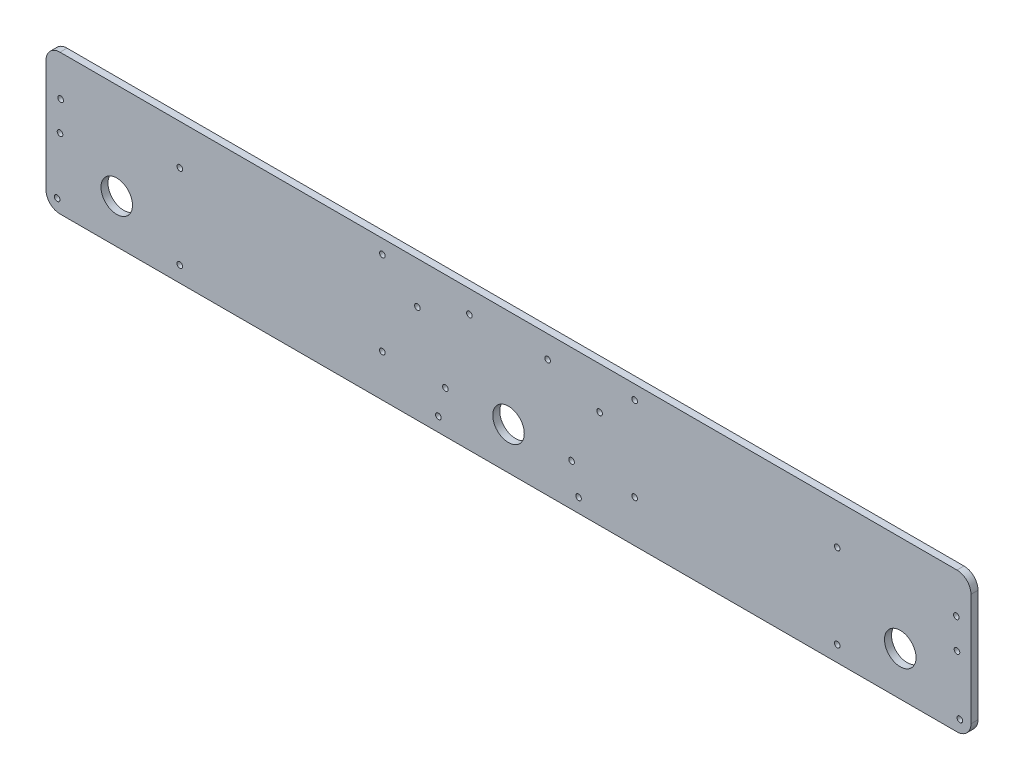
ISO-10303-21;
HEADER;
FILE_DESCRIPTION(('STEP AP214'),'2;1');
FILE_NAME('part.step','',(''),(''),'','','');
FILE_SCHEMA(('AUTOMOTIVE_DESIGN { 1 0 10303 214 1 1 1 1 }'));
ENDSEC;
DATA;
#1=APPLICATION_CONTEXT('core data for automotive mechanical design processes');
#2=APPLICATION_PROTOCOL_DEFINITION('international standard','automotive_design',2000,#1);
#3=PRODUCT_CONTEXT('',#1,'mechanical');
#4=PRODUCT('Part','Part','',(#3));
#5=PRODUCT_RELATED_PRODUCT_CATEGORY('part','',(#4));
#6=PRODUCT_DEFINITION_FORMATION('','',#4);
#7=PRODUCT_DEFINITION_CONTEXT('part definition',#1,'design');
#8=PRODUCT_DEFINITION('design','',#6,#7);
#9=PRODUCT_DEFINITION_SHAPE('','',#8);
#10=(LENGTH_UNIT() NAMED_UNIT(*) SI_UNIT(.MILLI.,.METRE.));
#11=(NAMED_UNIT(*) PLANE_ANGLE_UNIT() SI_UNIT($,.RADIAN.));
#12=(NAMED_UNIT(*) SI_UNIT($,.STERADIAN.) SOLID_ANGLE_UNIT());
#13=UNCERTAINTY_MEASURE_WITH_UNIT(LENGTH_MEASURE(1.E-05),#10,'distance_accuracy_value','');
#14=(GEOMETRIC_REPRESENTATION_CONTEXT(3) GLOBAL_UNCERTAINTY_ASSIGNED_CONTEXT((#13)) GLOBAL_UNIT_ASSIGNED_CONTEXT((#10,
#11,#12)) REPRESENTATION_CONTEXT('',''));
#15=CARTESIAN_POINT('',(0.,0.,0.));
#16=DIRECTION('',(0.,0.,1.));
#17=DIRECTION('',(1.,0.,0.));
#18=AXIS2_PLACEMENT_3D('',#15,#16,#17);
#19=CARTESIAN_POINT('',(-419.1,69.85,6.35));
#20=DIRECTION('',(1.,0.,0.));
#21=DIRECTION('',(0.,0.,-1.));
#22=AXIS2_PLACEMENT_3D('',#19,#20,#21);
#23=PLANE('',#22);
#24=DIRECTION('',(0.,-1.,0.));
#25=VECTOR('',#24,1.);
#26=CARTESIAN_POINT('',(-419.1,69.85,6.35));
#27=LINE('',#26,#25);
#28=CARTESIAN_POINT('',(-419.1,57.15,6.35));
#29=VERTEX_POINT('',#28);
#30=CARTESIAN_POINT('',(-419.1,-44.45,6.35));
#31=VERTEX_POINT('',#30);
#32=EDGE_CURVE('E127',#29,#31,#27,.T.);
#33=ORIENTED_EDGE('',*,*,#32,.F.);
#34=DIRECTION('',(0.,0.,-1.));
#35=VECTOR('',#34,1.);
#36=CARTESIAN_POINT('',(-419.1,57.15,6.35));
#37=LINE('',#36,#35);
#38=CARTESIAN_POINT('',(-419.1,57.15,0.));
#39=VERTEX_POINT('',#38);
#40=EDGE_CURVE('E11',#29,#39,#37,.T.);
#41=ORIENTED_EDGE('',*,*,#40,.T.);
#42=DIRECTION('',(0.,-1.,0.));
#43=VECTOR('',#42,1.);
#44=CARTESIAN_POINT('',(-419.1,69.85,0.));
#45=LINE('',#44,#43);
#46=CARTESIAN_POINT('',(-419.1,-44.45,0.));
#47=VERTEX_POINT('',#46);
#48=EDGE_CURVE('E129',#39,#47,#45,.T.);
#49=ORIENTED_EDGE('',*,*,#48,.T.);
#50=DIRECTION('',(0.,0.,-1.));
#51=VECTOR('',#50,1.);
#52=CARTESIAN_POINT('',(-419.1,-44.45,6.35));
#53=LINE('',#52,#51);
#54=EDGE_CURVE('E40',#47,#31,#53,.F.);
#55=ORIENTED_EDGE('',*,*,#54,.T.);
#56=EDGE_LOOP('',(#33,#41,#49,#55));
#57=FACE_BOUND('',#56,.T.);
#58=ADVANCED_FACE('F32',(#57),#23,.F.);
#59=CARTESIAN_POINT('',(-419.1,-57.15,6.35));
#60=DIRECTION('',(0.,1.,0.));
#61=DIRECTION('',(0.,0.,1.));
#62=AXIS2_PLACEMENT_3D('',#59,#60,#61);
#63=PLANE('',#62);
#64=DIRECTION('',(1.,0.,0.));
#65=VECTOR('',#64,1.);
#66=CARTESIAN_POINT('',(-419.1,-57.15,0.));
#67=LINE('',#66,#65);
#68=CARTESIAN_POINT('',(-406.4,-57.15,0.));
#69=VERTEX_POINT('',#68);
#70=CARTESIAN_POINT('',(406.4,-57.15,0.));
#71=VERTEX_POINT('',#70);
#72=EDGE_CURVE('E125',#69,#71,#67,.T.);
#73=ORIENTED_EDGE('',*,*,#72,.T.);
#74=DIRECTION('',(0.,0.,-1.));
#75=VECTOR('',#74,1.);
#76=CARTESIAN_POINT('',(406.4,-57.15,6.35));
#77=LINE('',#76,#75);
#78=CARTESIAN_POINT('',(406.4,-57.15,6.35));
#79=VERTEX_POINT('',#78);
#80=EDGE_CURVE('E104',#71,#79,#77,.F.);
#81=ORIENTED_EDGE('',*,*,#80,.T.);
#82=DIRECTION('',(1.,0.,0.));
#83=VECTOR('',#82,1.);
#84=CARTESIAN_POINT('',(-419.1,-57.15,6.35));
#85=LINE('',#84,#83);
#86=CARTESIAN_POINT('',(-406.4,-57.15,6.35));
#87=VERTEX_POINT('',#86);
#88=EDGE_CURVE('E165',#87,#79,#85,.T.);
#89=ORIENTED_EDGE('',*,*,#88,.F.);
#90=DIRECTION('',(0.,0.,-1.));
#91=VECTOR('',#90,1.);
#92=CARTESIAN_POINT('',(-406.4,-57.15,6.35));
#93=LINE('',#92,#91);
#94=EDGE_CURVE('E109',#87,#69,#93,.T.);
#95=ORIENTED_EDGE('',*,*,#94,.T.);
#96=EDGE_LOOP('',(#73,#81,#89,#95));
#97=FACE_BOUND('',#96,.T.);
#98=ADVANCED_FACE('F169',(#97),#63,.F.);
#99=CARTESIAN_POINT('',(419.1,69.85,6.35));
#100=DIRECTION('',(-1.,0.,0.));
#101=DIRECTION('',(0.,0.,1.));
#102=AXIS2_PLACEMENT_3D('',#99,#100,#101);
#103=PLANE('',#102);
#104=DIRECTION('',(0.,1.,0.));
#105=VECTOR('',#104,1.);
#106=CARTESIAN_POINT('',(419.1,69.85,6.35));
#107=LINE('',#106,#105);
#108=CARTESIAN_POINT('',(419.1,-44.45,6.35));
#109=VERTEX_POINT('',#108);
#110=CARTESIAN_POINT('',(419.1,57.15,6.35));
#111=VERTEX_POINT('',#110);
#112=EDGE_CURVE('E118',#109,#111,#107,.T.);
#113=ORIENTED_EDGE('',*,*,#112,.F.);
#114=DIRECTION('',(0.,0.,-1.));
#115=VECTOR('',#114,1.);
#116=CARTESIAN_POINT('',(419.1,-44.45,6.35));
#117=LINE('',#116,#115);
#118=CARTESIAN_POINT('',(419.1,-44.45,0.));
#119=VERTEX_POINT('',#118);
#120=EDGE_CURVE('E103',#109,#119,#117,.T.);
#121=ORIENTED_EDGE('',*,*,#120,.T.);
#122=DIRECTION('',(0.,1.,0.));
#123=VECTOR('',#122,1.);
#124=CARTESIAN_POINT('',(419.1,69.85,0.));
#125=LINE('',#124,#123);
#126=CARTESIAN_POINT('',(419.1,57.15,0.));
#127=VERTEX_POINT('',#126);
#128=EDGE_CURVE('E116',#119,#127,#125,.T.);
#129=ORIENTED_EDGE('',*,*,#128,.T.);
#130=DIRECTION('',(0.,0.,-1.));
#131=VECTOR('',#130,1.);
#132=CARTESIAN_POINT('',(419.1,57.15,6.35));
#133=LINE('',#132,#131);
#134=EDGE_CURVE('E120',#127,#111,#133,.F.);
#135=ORIENTED_EDGE('',*,*,#134,.T.);
#136=EDGE_LOOP('',(#113,#121,#129,#135));
#137=FACE_BOUND('',#136,.T.);
#138=ADVANCED_FACE('F115',(#137),#103,.F.);
#139=CARTESIAN_POINT('',(419.1,69.85,6.35));
#140=DIRECTION('',(0.,-1.,0.));
#141=DIRECTION('',(0.,0.,-1.));
#142=AXIS2_PLACEMENT_3D('',#139,#140,#141);
#143=PLANE('',#142);
#144=DIRECTION('',(-1.,0.,0.));
#145=VECTOR('',#144,1.);
#146=CARTESIAN_POINT('',(419.1,69.85,6.35));
#147=LINE('',#146,#145);
#148=CARTESIAN_POINT('',(406.4,69.85,6.35));
#149=VERTEX_POINT('',#148);
#150=CARTESIAN_POINT('',(-406.4,69.85,6.35));
#151=VERTEX_POINT('',#150);
#152=EDGE_CURVE('E133',#149,#151,#147,.T.);
#153=ORIENTED_EDGE('',*,*,#152,.F.);
#154=DIRECTION('',(0.,0.,-1.));
#155=VECTOR('',#154,1.);
#156=CARTESIAN_POINT('',(406.4,69.85,6.35));
#157=LINE('',#156,#155);
#158=CARTESIAN_POINT('',(406.4,69.85,0.));
#159=VERTEX_POINT('',#158);
#160=EDGE_CURVE('E150',#149,#159,#157,.T.);
#161=ORIENTED_EDGE('',*,*,#160,.T.);
#162=DIRECTION('',(-1.,0.,0.));
#163=VECTOR('',#162,1.);
#164=CARTESIAN_POINT('',(419.1,69.85,0.));
#165=LINE('',#164,#163);
#166=CARTESIAN_POINT('',(-406.4,69.85,0.));
#167=VERTEX_POINT('',#166);
#168=EDGE_CURVE('E124',#159,#167,#165,.T.);
#169=ORIENTED_EDGE('',*,*,#168,.T.);
#170=DIRECTION('',(0.,0.,-1.));
#171=VECTOR('',#170,1.);
#172=CARTESIAN_POINT('',(-406.4,69.85,6.35));
#173=LINE('',#172,#171);
#174=EDGE_CURVE('E47',#167,#151,#173,.F.);
#175=ORIENTED_EDGE('',*,*,#174,.T.);
#176=EDGE_LOOP('',(#153,#161,#169,#175));
#177=FACE_BOUND('',#176,.T.);
#178=ADVANCED_FACE('F336',(#177),#143,.F.);
#179=CARTESIAN_POINT('',(0.,0.,6.35));
#180=DIRECTION('',(0.,0.,1.));
#181=DIRECTION('',(1.,0.,0.));
#182=AXIS2_PLACEMENT_3D('',#179,#180,#181);
#183=PLANE('',#182);
#184=CARTESIAN_POINT('',(114.3,-19.05,6.35));
#185=DIRECTION('',(0.,0.,1.));
#186=DIRECTION('',(-1.,0.,0.));
#187=AXIS2_PLACEMENT_3D('',#184,#185,#186);
#188=CIRCLE('',#187,2.5527);
#189=CARTESIAN_POINT('',(111.7473,-19.05,6.35));
#190=VERTEX_POINT('',#189);
#191=EDGE_CURVE('E319',#190,#190,#188,.T.);
#192=ORIENTED_EDGE('',*,*,#191,.F.);
#193=EDGE_LOOP('',(#192));
#194=FACE_BOUND('',#193,.T.);
#195=CARTESIAN_POINT('',(114.3,57.1499999999999,6.35));
#196=DIRECTION('',(0.,0.,1.));
#197=DIRECTION('',(-1.,0.,0.));
#198=AXIS2_PLACEMENT_3D('',#195,#196,#197);
#199=CIRCLE('',#198,2.5527);
#200=CARTESIAN_POINT('',(111.7473,57.1499999999999,6.35));
#201=VERTEX_POINT('',#200);
#202=EDGE_CURVE('E313',#201,#201,#199,.T.);
#203=ORIENTED_EDGE('',*,*,#202,.F.);
#204=EDGE_LOOP('',(#203));
#205=FACE_BOUND('',#204,.T.);
#206=CARTESIAN_POINT('',(-114.3,-19.05,6.35));
#207=DIRECTION('',(0.,0.,1.));
#208=DIRECTION('',(1.,0.,0.));
#209=AXIS2_PLACEMENT_3D('',#206,#207,#208);
#210=CIRCLE('',#209,2.5527);
#211=CARTESIAN_POINT('',(-111.7473,-19.05,6.35));
#212=VERTEX_POINT('',#211);
#213=EDGE_CURVE('E307',#212,#212,#210,.T.);
#214=ORIENTED_EDGE('',*,*,#213,.F.);
#215=EDGE_LOOP('',(#214));
#216=FACE_BOUND('',#215,.T.);
#217=CARTESIAN_POINT('',(-114.3,57.1499999999999,6.35));
#218=DIRECTION('',(0.,0.,1.));
#219=DIRECTION('',(1.,0.,0.));
#220=AXIS2_PLACEMENT_3D('',#217,#218,#219);
#221=CIRCLE('',#220,2.5527);
#222=CARTESIAN_POINT('',(-111.7473,57.1499999999999,6.35));
#223=VERTEX_POINT('',#222);
#224=EDGE_CURVE('E301',#223,#223,#221,.T.);
#225=ORIENTED_EDGE('',*,*,#224,.F.);
#226=EDGE_LOOP('',(#225));
#227=FACE_BOUND('',#226,.T.);
#228=CARTESIAN_POINT('',(406.4,6.35000000000001,6.35));
#229=DIRECTION('',(0.,0.,1.));
#230=DIRECTION('',(1.,0.,0.));
#231=AXIS2_PLACEMENT_3D('',#228,#229,#230);
#232=CIRCLE('',#231,2.55269999999998);
#233=CARTESIAN_POINT('',(408.9527,6.35000000000001,6.35));
#234=VERTEX_POINT('',#233);
#235=EDGE_CURVE('E295',#234,#234,#232,.T.);
#236=ORIENTED_EDGE('',*,*,#235,.F.);
#237=EDGE_LOOP('',(#236));
#238=FACE_BOUND('',#237,.T.);
#239=CARTESIAN_POINT('',(-406.4,6.35000000000001,6.35));
#240=DIRECTION('',(0.,0.,1.));
#241=DIRECTION('',(1.,0.,0.));
#242=AXIS2_PLACEMENT_3D('',#239,#240,#241);
#243=CIRCLE('',#242,2.55270000000004);
#244=CARTESIAN_POINT('',(-403.8473,6.35000000000001,6.35));
#245=VERTEX_POINT('',#244);
#246=EDGE_CURVE('E289',#245,#245,#243,.T.);
#247=ORIENTED_EDGE('',*,*,#246,.F.);
#248=EDGE_LOOP('',(#247));
#249=FACE_BOUND('',#248,.T.);
#250=CARTESIAN_POINT('',(-82.55,31.75,6.35));
#251=DIRECTION('',(0.,0.,1.));
#252=DIRECTION('',(-1.,0.,0.));
#253=AXIS2_PLACEMENT_3D('',#250,#251,#252);
#254=CIRCLE('',#253,2.55270000000001);
#255=CARTESIAN_POINT('',(-85.1027,31.75,6.35));
#256=VERTEX_POINT('',#255);
#257=EDGE_CURVE('E283',#256,#256,#254,.T.);
#258=ORIENTED_EDGE('',*,*,#257,.F.);
#259=EDGE_LOOP('',(#258));
#260=FACE_BOUND('',#259,.T.);
#261=CARTESIAN_POINT('',(297.84802,33.3374999999999,6.35));
#262=DIRECTION('',(0.,0.,1.));
#263=DIRECTION('',(1.,0.,0.));
#264=AXIS2_PLACEMENT_3D('',#261,#262,#263);
#265=CIRCLE('',#264,2.55270000000004);
#266=CARTESIAN_POINT('',(300.40072,33.3374999999999,6.35));
#267=VERTEX_POINT('',#266);
#268=EDGE_CURVE('E277',#267,#267,#265,.T.);
#269=ORIENTED_EDGE('',*,*,#268,.F.);
#270=EDGE_LOOP('',(#269));
#271=FACE_BOUND('',#270,.T.);
#272=CARTESIAN_POINT('',(-297.84802,33.3374999999999,6.35));
#273=DIRECTION('',(0.,0.,1.));
#274=DIRECTION('',(-1.,0.,0.));
#275=AXIS2_PLACEMENT_3D('',#272,#273,#274);
#276=CIRCLE('',#275,2.55270000000004);
#277=CARTESIAN_POINT('',(-300.40072,33.3374999999999,6.35));
#278=VERTEX_POINT('',#277);
#279=EDGE_CURVE('E271',#278,#278,#276,.T.);
#280=ORIENTED_EDGE('',*,*,#279,.F.);
#281=EDGE_LOOP('',(#280));
#282=FACE_BOUND('',#281,.T.);
#283=CARTESIAN_POINT('',(82.55,31.75,6.35));
#284=DIRECTION('',(0.,0.,1.));
#285=DIRECTION('',(1.,0.,0.));
#286=AXIS2_PLACEMENT_3D('',#283,#284,#285);
#287=CIRCLE('',#286,2.55270000000001);
#288=CARTESIAN_POINT('',(85.1027,31.75,6.35));
#289=VERTEX_POINT('',#288);
#290=EDGE_CURVE('E265',#289,#289,#287,.T.);
#291=ORIENTED_EDGE('',*,*,#290,.F.);
#292=EDGE_LOOP('',(#291));
#293=FACE_BOUND('',#292,.T.);
#294=CARTESIAN_POINT('',(297.84802,-42.8625,6.35));
#295=DIRECTION('',(0.,0.,1.));
#296=DIRECTION('',(-1.,0.,0.));
#297=AXIS2_PLACEMENT_3D('',#294,#295,#296);
#298=CIRCLE('',#297,2.55270000000004);
#299=CARTESIAN_POINT('',(295.29532,-42.8625,6.35));
#300=VERTEX_POINT('',#299);
#301=EDGE_CURVE('E259',#300,#300,#298,.T.);
#302=ORIENTED_EDGE('',*,*,#301,.F.);
#303=EDGE_LOOP('',(#302));
#304=FACE_BOUND('',#303,.T.);
#305=CARTESIAN_POINT('',(-63.5,-44.45,6.35));
#306=DIRECTION('',(0.,0.,1.));
#307=DIRECTION('',(-1.,0.,0.));
#308=AXIS2_PLACEMENT_3D('',#305,#306,#307);
#309=CIRCLE('',#308,2.55270000000001);
#310=CARTESIAN_POINT('',(-66.0527,-44.45,6.35));
#311=VERTEX_POINT('',#310);
#312=EDGE_CURVE('E253',#311,#311,#309,.T.);
#313=ORIENTED_EDGE('',*,*,#312,.F.);
#314=EDGE_LOOP('',(#313));
#315=FACE_BOUND('',#314,.T.);
#316=CARTESIAN_POINT('',(-297.84802,-42.8625,6.35));
#317=DIRECTION('',(0.,0.,1.));
#318=DIRECTION('',(1.,0.,0.));
#319=AXIS2_PLACEMENT_3D('',#316,#317,#318);
#320=CIRCLE('',#319,2.55270000000004);
#321=CARTESIAN_POINT('',(-295.29532,-42.8625,6.35));
#322=VERTEX_POINT('',#321);
#323=EDGE_CURVE('E247',#322,#322,#320,.T.);
#324=ORIENTED_EDGE('',*,*,#323,.F.);
#325=EDGE_LOOP('',(#324));
#326=FACE_BOUND('',#325,.T.);
#327=CARTESIAN_POINT('',(63.5,-44.45,6.35));
#328=DIRECTION('',(0.,0.,1.));
#329=DIRECTION('',(1.,0.,0.));
#330=AXIS2_PLACEMENT_3D('',#327,#328,#329);
#331=CIRCLE('',#330,2.55270000000001);
#332=CARTESIAN_POINT('',(66.0527,-44.45,6.35));
#333=VERTEX_POINT('',#332);
#334=EDGE_CURVE('E241',#333,#333,#331,.T.);
#335=ORIENTED_EDGE('',*,*,#334,.F.);
#336=EDGE_LOOP('',(#335));
#337=FACE_BOUND('',#336,.T.);
#338=CARTESIAN_POINT('',(-408.97302,-46.0375,6.35));
#339=DIRECTION('',(0.,0.,1.));
#340=DIRECTION('',(1.,0.,0.));
#341=AXIS2_PLACEMENT_3D('',#338,#339,#340);
#342=CIRCLE('',#341,2.55270000000004);
#343=CARTESIAN_POINT('',(-406.42032,-46.0375,6.35));
#344=VERTEX_POINT('',#343);
#345=EDGE_CURVE('E235',#344,#344,#342,.T.);
#346=ORIENTED_EDGE('',*,*,#345,.F.);
#347=EDGE_LOOP('',(#346));
#348=FACE_BOUND('',#347,.T.);
#349=CARTESIAN_POINT('',(405.79802,33.3374999999999,6.35));
#350=DIRECTION('',(0.,0.,1.));
#351=DIRECTION('',(1.,0.,0.));
#352=AXIS2_PLACEMENT_3D('',#349,#350,#351);
#353=CIRCLE('',#352,2.55270000000004);
#354=CARTESIAN_POINT('',(408.35072,33.3374999999999,6.35));
#355=VERTEX_POINT('',#354);
#356=EDGE_CURVE('E229',#355,#355,#353,.T.);
#357=ORIENTED_EDGE('',*,*,#356,.F.);
#358=EDGE_LOOP('',(#357));
#359=FACE_BOUND('',#358,.T.);
#360=CARTESIAN_POINT('',(408.97302,-46.0375,6.35));
#361=DIRECTION('',(0.,0.,1.));
#362=DIRECTION('',(1.,0.,0.));
#363=AXIS2_PLACEMENT_3D('',#360,#361,#362);
#364=CIRCLE('',#363,2.55270000000004);
#365=CARTESIAN_POINT('',(411.52572,-46.0375,6.35));
#366=VERTEX_POINT('',#365);
#367=EDGE_CURVE('E223',#366,#366,#364,.T.);
#368=ORIENTED_EDGE('',*,*,#367,.F.);
#369=EDGE_LOOP('',(#368));
#370=FACE_BOUND('',#369,.T.);
#371=CARTESIAN_POINT('',(-405.79802,33.3374999999999,6.35));
#372=DIRECTION('',(0.,0.,1.));
#373=DIRECTION('',(1.,0.,0.));
#374=AXIS2_PLACEMENT_3D('',#371,#372,#373);
#375=CIRCLE('',#374,2.55270000000004);
#376=CARTESIAN_POINT('',(-403.24532,33.3374999999999,6.35));
#377=VERTEX_POINT('',#376);
#378=EDGE_CURVE('E217',#377,#377,#375,.T.);
#379=ORIENTED_EDGE('',*,*,#378,.F.);
#380=EDGE_LOOP('',(#379));
#381=FACE_BOUND('',#380,.T.);
#382=CARTESIAN_POINT('',(35.41268,49.5808,6.35));
#383=DIRECTION('',(0.,0.,1.));
#384=DIRECTION('',(-1.,0.,0.));
#385=AXIS2_PLACEMENT_3D('',#382,#383,#384);
#386=CIRCLE('',#385,2.5527);
#387=CARTESIAN_POINT('',(32.85998,49.5808,6.35));
#388=VERTEX_POINT('',#387);
#389=EDGE_CURVE('E211',#388,#388,#386,.T.);
#390=ORIENTED_EDGE('',*,*,#389,.F.);
#391=EDGE_LOOP('',(#390));
#392=FACE_BOUND('',#391,.T.);
#393=CARTESIAN_POINT('',(57.15,-19.05,6.35));
#394=DIRECTION('',(0.,0.,1.));
#395=DIRECTION('',(-1.,0.,0.));
#396=AXIS2_PLACEMENT_3D('',#393,#394,#395);
#397=CIRCLE('',#396,2.5527);
#398=CARTESIAN_POINT('',(54.5973,-19.05,6.35));
#399=VERTEX_POINT('',#398);
#400=EDGE_CURVE('E205',#399,#399,#397,.T.);
#401=ORIENTED_EDGE('',*,*,#400,.F.);
#402=EDGE_LOOP('',(#401));
#403=FACE_BOUND('',#402,.T.);
#404=CARTESIAN_POINT('',(-57.15,-19.05,6.35));
#405=DIRECTION('',(0.,0.,1.));
#406=DIRECTION('',(1.,0.,0.));
#407=AXIS2_PLACEMENT_3D('',#404,#405,#406);
#408=CIRCLE('',#407,2.5527);
#409=CARTESIAN_POINT('',(-54.5973,-19.05,6.35));
#410=VERTEX_POINT('',#409);
#411=EDGE_CURVE('E199',#410,#410,#408,.T.);
#412=ORIENTED_EDGE('',*,*,#411,.F.);
#413=EDGE_LOOP('',(#412));
#414=FACE_BOUND('',#413,.T.);
#415=CARTESIAN_POINT('',(-35.41268,49.5808,6.35));
#416=DIRECTION('',(0.,0.,1.));
#417=DIRECTION('',(1.,0.,0.));
#418=AXIS2_PLACEMENT_3D('',#415,#416,#417);
#419=CIRCLE('',#418,2.5527);
#420=CARTESIAN_POINT('',(-32.85998,49.5808,6.35));
#421=VERTEX_POINT('',#420);
#422=EDGE_CURVE('E193',#421,#421,#419,.T.);
#423=ORIENTED_EDGE('',*,*,#422,.F.);
#424=EDGE_LOOP('',(#423));
#425=FACE_BOUND('',#424,.T.);
#426=CARTESIAN_POINT('',(354.99802,-17.4625,6.35));
#427=DIRECTION('',(0.,0.,1.));
#428=DIRECTION('',(-1.,0.,0.));
#429=AXIS2_PLACEMENT_3D('',#426,#427,#428);
#430=CIRCLE('',#429,14.2875);
#431=CARTESIAN_POINT('',(340.71052,-17.4625,6.35));
#432=VERTEX_POINT('',#431);
#433=EDGE_CURVE('E187',#432,#432,#430,.T.);
#434=ORIENTED_EDGE('',*,*,#433,.F.);
#435=EDGE_LOOP('',(#434));
#436=FACE_BOUND('',#435,.T.);
#437=CARTESIAN_POINT('',(-354.99802,-17.4625,6.35));
#438=DIRECTION('',(0.,0.,1.));
#439=DIRECTION('',(1.,0.,0.));
#440=AXIS2_PLACEMENT_3D('',#437,#438,#439);
#441=CIRCLE('',#440,14.2875);
#442=CARTESIAN_POINT('',(-340.71052,-17.4625,6.35));
#443=VERTEX_POINT('',#442);
#444=EDGE_CURVE('E181',#443,#443,#441,.T.);
#445=ORIENTED_EDGE('',*,*,#444,.F.);
#446=EDGE_LOOP('',(#445));
#447=FACE_BOUND('',#446,.T.);
#448=CARTESIAN_POINT('',(0.,-19.05,6.35));
#449=DIRECTION('',(0.,0.,1.));
#450=DIRECTION('',(1.,0.,0.));
#451=AXIS2_PLACEMENT_3D('',#448,#449,#450);
#452=CIRCLE('',#451,14.2875);
#453=CARTESIAN_POINT('',(14.2875,-19.05,6.35));
#454=VERTEX_POINT('',#453);
#455=EDGE_CURVE('E172',#454,#454,#452,.T.);
#456=ORIENTED_EDGE('',*,*,#455,.F.);
#457=EDGE_LOOP('',(#456));
#458=FACE_BOUND('',#457,.T.);
#459=ORIENTED_EDGE('',*,*,#88,.T.);
#460=CARTESIAN_POINT('',(406.4,-44.45,6.35));
#461=DIRECTION('',(0.,0.,1.));
#462=DIRECTION('',(1.,0.,0.));
#463=AXIS2_PLACEMENT_3D('',#460,#461,#462);
#464=CIRCLE('',#463,12.7);
#465=EDGE_CURVE('E147',#79,#109,#464,.T.);
#466=ORIENTED_EDGE('',*,*,#465,.T.);
#467=ORIENTED_EDGE('',*,*,#112,.T.);
#468=CARTESIAN_POINT('',(406.4,57.15,6.35));
#469=DIRECTION('',(0.,0.,1.));
#470=DIRECTION('',(1.,0.,0.));
#471=AXIS2_PLACEMENT_3D('',#468,#469,#470);
#472=CIRCLE('',#471,12.7);
#473=EDGE_CURVE('E54',#111,#149,#472,.T.);
#474=ORIENTED_EDGE('',*,*,#473,.T.);
#475=ORIENTED_EDGE('',*,*,#152,.T.);
#476=CARTESIAN_POINT('',(-406.4,57.15,6.35));
#477=DIRECTION('',(0.,0.,1.));
#478=DIRECTION('',(1.,0.,0.));
#479=AXIS2_PLACEMENT_3D('',#476,#477,#478);
#480=CIRCLE('',#479,12.7);
#481=EDGE_CURVE('E144',#151,#29,#480,.T.);
#482=ORIENTED_EDGE('',*,*,#481,.T.);
#483=ORIENTED_EDGE('',*,*,#32,.T.);
#484=CARTESIAN_POINT('',(-406.4,-44.45,6.35));
#485=DIRECTION('',(0.,0.,1.));
#486=DIRECTION('',(1.,0.,0.));
#487=AXIS2_PLACEMENT_3D('',#484,#485,#486);
#488=CIRCLE('',#487,12.7);
#489=EDGE_CURVE('E142',#31,#87,#488,.T.);
#490=ORIENTED_EDGE('',*,*,#489,.T.);
#491=EDGE_LOOP('',(#459,#466,#467,#474,#475,#482,#483,#490));
#492=FACE_BOUND('',#491,.T.);
#493=ADVANCED_FACE('F162',(#194,#205,#216,#227,#238,#249,#260,#271,#282,#293,#304,#315,#326,
#337,#348,#359,#370,#381,#392,#403,#414,#425,#436,#447,#458,#492),#183,.T.);
#494=CARTESIAN_POINT('',(0.,0.,0.));
#495=DIRECTION('',(0.,0.,1.));
#496=DIRECTION('',(1.,0.,0.));
#497=AXIS2_PLACEMENT_3D('',#494,#495,#496);
#498=PLANE('',#497);
#499=CARTESIAN_POINT('',(114.3,-19.05,0.));
#500=DIRECTION('',(0.,0.,1.));
#501=DIRECTION('',(-1.,0.,0.));
#502=AXIS2_PLACEMENT_3D('',#499,#500,#501);
#503=CIRCLE('',#502,2.5527);
#504=CARTESIAN_POINT('',(111.7473,-19.05,0.));
#505=VERTEX_POINT('',#504);
#506=EDGE_CURVE('E316',#505,#505,#503,.T.);
#507=ORIENTED_EDGE('',*,*,#506,.T.);
#508=EDGE_LOOP('',(#507));
#509=FACE_BOUND('',#508,.T.);
#510=CARTESIAN_POINT('',(114.3,57.1499999999999,0.));
#511=DIRECTION('',(0.,0.,1.));
#512=DIRECTION('',(-1.,0.,0.));
#513=AXIS2_PLACEMENT_3D('',#510,#511,#512);
#514=CIRCLE('',#513,2.5527);
#515=CARTESIAN_POINT('',(111.7473,57.1499999999999,0.));
#516=VERTEX_POINT('',#515);
#517=EDGE_CURVE('E310',#516,#516,#514,.T.);
#518=ORIENTED_EDGE('',*,*,#517,.T.);
#519=EDGE_LOOP('',(#518));
#520=FACE_BOUND('',#519,.T.);
#521=CARTESIAN_POINT('',(-114.3,-19.05,0.));
#522=DIRECTION('',(0.,0.,1.));
#523=DIRECTION('',(1.,0.,0.));
#524=AXIS2_PLACEMENT_3D('',#521,#522,#523);
#525=CIRCLE('',#524,2.5527);
#526=CARTESIAN_POINT('',(-111.7473,-19.05,0.));
#527=VERTEX_POINT('',#526);
#528=EDGE_CURVE('E304',#527,#527,#525,.T.);
#529=ORIENTED_EDGE('',*,*,#528,.T.);
#530=EDGE_LOOP('',(#529));
#531=FACE_BOUND('',#530,.T.);
#532=CARTESIAN_POINT('',(-114.3,57.1499999999999,0.));
#533=DIRECTION('',(0.,0.,1.));
#534=DIRECTION('',(1.,0.,0.));
#535=AXIS2_PLACEMENT_3D('',#532,#533,#534);
#536=CIRCLE('',#535,2.5527);
#537=CARTESIAN_POINT('',(-111.7473,57.1499999999999,0.));
#538=VERTEX_POINT('',#537);
#539=EDGE_CURVE('E298',#538,#538,#536,.T.);
#540=ORIENTED_EDGE('',*,*,#539,.T.);
#541=EDGE_LOOP('',(#540));
#542=FACE_BOUND('',#541,.T.);
#543=CARTESIAN_POINT('',(406.4,6.35000000000001,0.));
#544=DIRECTION('',(0.,0.,1.));
#545=DIRECTION('',(1.,0.,0.));
#546=AXIS2_PLACEMENT_3D('',#543,#544,#545);
#547=CIRCLE('',#546,2.55269999999998);
#548=CARTESIAN_POINT('',(408.9527,6.35000000000001,0.));
#549=VERTEX_POINT('',#548);
#550=EDGE_CURVE('E292',#549,#549,#547,.T.);
#551=ORIENTED_EDGE('',*,*,#550,.T.);
#552=EDGE_LOOP('',(#551));
#553=FACE_BOUND('',#552,.T.);
#554=CARTESIAN_POINT('',(-406.4,6.35000000000001,0.));
#555=DIRECTION('',(0.,0.,1.));
#556=DIRECTION('',(1.,0.,0.));
#557=AXIS2_PLACEMENT_3D('',#554,#555,#556);
#558=CIRCLE('',#557,2.55270000000004);
#559=CARTESIAN_POINT('',(-403.8473,6.35000000000001,0.));
#560=VERTEX_POINT('',#559);
#561=EDGE_CURVE('E286',#560,#560,#558,.T.);
#562=ORIENTED_EDGE('',*,*,#561,.T.);
#563=EDGE_LOOP('',(#562));
#564=FACE_BOUND('',#563,.T.);
#565=CARTESIAN_POINT('',(-82.55,31.75,0.));
#566=DIRECTION('',(0.,0.,1.));
#567=DIRECTION('',(-1.,0.,0.));
#568=AXIS2_PLACEMENT_3D('',#565,#566,#567);
#569=CIRCLE('',#568,2.55270000000001);
#570=CARTESIAN_POINT('',(-85.1027,31.75,0.));
#571=VERTEX_POINT('',#570);
#572=EDGE_CURVE('E280',#571,#571,#569,.T.);
#573=ORIENTED_EDGE('',*,*,#572,.T.);
#574=EDGE_LOOP('',(#573));
#575=FACE_BOUND('',#574,.T.);
#576=CARTESIAN_POINT('',(297.84802,33.3374999999999,0.));
#577=DIRECTION('',(0.,0.,1.));
#578=DIRECTION('',(1.,0.,0.));
#579=AXIS2_PLACEMENT_3D('',#576,#577,#578);
#580=CIRCLE('',#579,2.55270000000004);
#581=CARTESIAN_POINT('',(300.40072,33.3374999999999,0.));
#582=VERTEX_POINT('',#581);
#583=EDGE_CURVE('E274',#582,#582,#580,.T.);
#584=ORIENTED_EDGE('',*,*,#583,.T.);
#585=EDGE_LOOP('',(#584));
#586=FACE_BOUND('',#585,.T.);
#587=CARTESIAN_POINT('',(-297.84802,33.3374999999999,0.));
#588=DIRECTION('',(0.,0.,1.));
#589=DIRECTION('',(-1.,0.,0.));
#590=AXIS2_PLACEMENT_3D('',#587,#588,#589);
#591=CIRCLE('',#590,2.55270000000004);
#592=CARTESIAN_POINT('',(-300.40072,33.3374999999999,0.));
#593=VERTEX_POINT('',#592);
#594=EDGE_CURVE('E268',#593,#593,#591,.T.);
#595=ORIENTED_EDGE('',*,*,#594,.T.);
#596=EDGE_LOOP('',(#595));
#597=FACE_BOUND('',#596,.T.);
#598=CARTESIAN_POINT('',(82.55,31.75,0.));
#599=DIRECTION('',(0.,0.,1.));
#600=DIRECTION('',(1.,0.,0.));
#601=AXIS2_PLACEMENT_3D('',#598,#599,#600);
#602=CIRCLE('',#601,2.55270000000001);
#603=CARTESIAN_POINT('',(85.1027,31.75,0.));
#604=VERTEX_POINT('',#603);
#605=EDGE_CURVE('E262',#604,#604,#602,.T.);
#606=ORIENTED_EDGE('',*,*,#605,.T.);
#607=EDGE_LOOP('',(#606));
#608=FACE_BOUND('',#607,.T.);
#609=CARTESIAN_POINT('',(297.84802,-42.8625,0.));
#610=DIRECTION('',(0.,0.,1.));
#611=DIRECTION('',(-1.,0.,0.));
#612=AXIS2_PLACEMENT_3D('',#609,#610,#611);
#613=CIRCLE('',#612,2.55270000000004);
#614=CARTESIAN_POINT('',(295.29532,-42.8625,0.));
#615=VERTEX_POINT('',#614);
#616=EDGE_CURVE('E256',#615,#615,#613,.T.);
#617=ORIENTED_EDGE('',*,*,#616,.T.);
#618=EDGE_LOOP('',(#617));
#619=FACE_BOUND('',#618,.T.);
#620=CARTESIAN_POINT('',(-63.5,-44.45,0.));
#621=DIRECTION('',(0.,0.,1.));
#622=DIRECTION('',(-1.,0.,0.));
#623=AXIS2_PLACEMENT_3D('',#620,#621,#622);
#624=CIRCLE('',#623,2.55270000000001);
#625=CARTESIAN_POINT('',(-66.0527,-44.45,0.));
#626=VERTEX_POINT('',#625);
#627=EDGE_CURVE('E250',#626,#626,#624,.T.);
#628=ORIENTED_EDGE('',*,*,#627,.T.);
#629=EDGE_LOOP('',(#628));
#630=FACE_BOUND('',#629,.T.);
#631=CARTESIAN_POINT('',(-297.84802,-42.8625,0.));
#632=DIRECTION('',(0.,0.,1.));
#633=DIRECTION('',(1.,0.,0.));
#634=AXIS2_PLACEMENT_3D('',#631,#632,#633);
#635=CIRCLE('',#634,2.55270000000004);
#636=CARTESIAN_POINT('',(-295.29532,-42.8625,0.));
#637=VERTEX_POINT('',#636);
#638=EDGE_CURVE('E244',#637,#637,#635,.T.);
#639=ORIENTED_EDGE('',*,*,#638,.T.);
#640=EDGE_LOOP('',(#639));
#641=FACE_BOUND('',#640,.T.);
#642=CARTESIAN_POINT('',(63.5,-44.45,0.));
#643=DIRECTION('',(0.,0.,1.));
#644=DIRECTION('',(1.,0.,0.));
#645=AXIS2_PLACEMENT_3D('',#642,#643,#644);
#646=CIRCLE('',#645,2.55270000000001);
#647=CARTESIAN_POINT('',(66.0527,-44.45,0.));
#648=VERTEX_POINT('',#647);
#649=EDGE_CURVE('E238',#648,#648,#646,.T.);
#650=ORIENTED_EDGE('',*,*,#649,.T.);
#651=EDGE_LOOP('',(#650));
#652=FACE_BOUND('',#651,.T.);
#653=CARTESIAN_POINT('',(-408.97302,-46.0375,0.));
#654=DIRECTION('',(0.,0.,1.));
#655=DIRECTION('',(1.,0.,0.));
#656=AXIS2_PLACEMENT_3D('',#653,#654,#655);
#657=CIRCLE('',#656,2.55270000000004);
#658=CARTESIAN_POINT('',(-406.42032,-46.0375,0.));
#659=VERTEX_POINT('',#658);
#660=EDGE_CURVE('E232',#659,#659,#657,.T.);
#661=ORIENTED_EDGE('',*,*,#660,.T.);
#662=EDGE_LOOP('',(#661));
#663=FACE_BOUND('',#662,.T.);
#664=CARTESIAN_POINT('',(405.79802,33.3374999999999,0.));
#665=DIRECTION('',(0.,0.,1.));
#666=DIRECTION('',(1.,0.,0.));
#667=AXIS2_PLACEMENT_3D('',#664,#665,#666);
#668=CIRCLE('',#667,2.55270000000004);
#669=CARTESIAN_POINT('',(408.35072,33.3374999999999,0.));
#670=VERTEX_POINT('',#669);
#671=EDGE_CURVE('E226',#670,#670,#668,.T.);
#672=ORIENTED_EDGE('',*,*,#671,.T.);
#673=EDGE_LOOP('',(#672));
#674=FACE_BOUND('',#673,.T.);
#675=CARTESIAN_POINT('',(408.97302,-46.0375,0.));
#676=DIRECTION('',(0.,0.,1.));
#677=DIRECTION('',(1.,0.,0.));
#678=AXIS2_PLACEMENT_3D('',#675,#676,#677);
#679=CIRCLE('',#678,2.55270000000004);
#680=CARTESIAN_POINT('',(411.52572,-46.0375,0.));
#681=VERTEX_POINT('',#680);
#682=EDGE_CURVE('E220',#681,#681,#679,.T.);
#683=ORIENTED_EDGE('',*,*,#682,.T.);
#684=EDGE_LOOP('',(#683));
#685=FACE_BOUND('',#684,.T.);
#686=CARTESIAN_POINT('',(-405.79802,33.3374999999999,0.));
#687=DIRECTION('',(0.,0.,1.));
#688=DIRECTION('',(1.,0.,0.));
#689=AXIS2_PLACEMENT_3D('',#686,#687,#688);
#690=CIRCLE('',#689,2.55270000000004);
#691=CARTESIAN_POINT('',(-403.24532,33.3374999999999,0.));
#692=VERTEX_POINT('',#691);
#693=EDGE_CURVE('E214',#692,#692,#690,.T.);
#694=ORIENTED_EDGE('',*,*,#693,.T.);
#695=EDGE_LOOP('',(#694));
#696=FACE_BOUND('',#695,.T.);
#697=CARTESIAN_POINT('',(35.41268,49.5808,0.));
#698=DIRECTION('',(0.,0.,1.));
#699=DIRECTION('',(-1.,0.,0.));
#700=AXIS2_PLACEMENT_3D('',#697,#698,#699);
#701=CIRCLE('',#700,2.5527);
#702=CARTESIAN_POINT('',(32.85998,49.5808,0.));
#703=VERTEX_POINT('',#702);
#704=EDGE_CURVE('E208',#703,#703,#701,.T.);
#705=ORIENTED_EDGE('',*,*,#704,.T.);
#706=EDGE_LOOP('',(#705));
#707=FACE_BOUND('',#706,.T.);
#708=CARTESIAN_POINT('',(57.15,-19.05,0.));
#709=DIRECTION('',(0.,0.,1.));
#710=DIRECTION('',(-1.,0.,0.));
#711=AXIS2_PLACEMENT_3D('',#708,#709,#710);
#712=CIRCLE('',#711,2.5527);
#713=CARTESIAN_POINT('',(54.5973,-19.05,0.));
#714=VERTEX_POINT('',#713);
#715=EDGE_CURVE('E202',#714,#714,#712,.T.);
#716=ORIENTED_EDGE('',*,*,#715,.T.);
#717=EDGE_LOOP('',(#716));
#718=FACE_BOUND('',#717,.T.);
#719=CARTESIAN_POINT('',(-57.15,-19.05,0.));
#720=DIRECTION('',(0.,0.,1.));
#721=DIRECTION('',(1.,0.,0.));
#722=AXIS2_PLACEMENT_3D('',#719,#720,#721);
#723=CIRCLE('',#722,2.5527);
#724=CARTESIAN_POINT('',(-54.5973,-19.05,0.));
#725=VERTEX_POINT('',#724);
#726=EDGE_CURVE('E196',#725,#725,#723,.T.);
#727=ORIENTED_EDGE('',*,*,#726,.T.);
#728=EDGE_LOOP('',(#727));
#729=FACE_BOUND('',#728,.T.);
#730=CARTESIAN_POINT('',(-35.41268,49.5808,0.));
#731=DIRECTION('',(0.,0.,1.));
#732=DIRECTION('',(1.,0.,0.));
#733=AXIS2_PLACEMENT_3D('',#730,#731,#732);
#734=CIRCLE('',#733,2.5527);
#735=CARTESIAN_POINT('',(-32.85998,49.5808,0.));
#736=VERTEX_POINT('',#735);
#737=EDGE_CURVE('E190',#736,#736,#734,.T.);
#738=ORIENTED_EDGE('',*,*,#737,.T.);
#739=EDGE_LOOP('',(#738));
#740=FACE_BOUND('',#739,.T.);
#741=CARTESIAN_POINT('',(354.99802,-17.4625,0.));
#742=DIRECTION('',(0.,0.,1.));
#743=DIRECTION('',(-1.,0.,0.));
#744=AXIS2_PLACEMENT_3D('',#741,#742,#743);
#745=CIRCLE('',#744,14.2875);
#746=CARTESIAN_POINT('',(340.71052,-17.4625,0.));
#747=VERTEX_POINT('',#746);
#748=EDGE_CURVE('E184',#747,#747,#745,.T.);
#749=ORIENTED_EDGE('',*,*,#748,.T.);
#750=EDGE_LOOP('',(#749));
#751=FACE_BOUND('',#750,.T.);
#752=CARTESIAN_POINT('',(-354.99802,-17.4625,0.));
#753=DIRECTION('',(0.,0.,1.));
#754=DIRECTION('',(1.,0.,0.));
#755=AXIS2_PLACEMENT_3D('',#752,#753,#754);
#756=CIRCLE('',#755,14.2875);
#757=CARTESIAN_POINT('',(-340.71052,-17.4625,0.));
#758=VERTEX_POINT('',#757);
#759=EDGE_CURVE('E179',#758,#758,#756,.T.);
#760=ORIENTED_EDGE('',*,*,#759,.T.);
#761=EDGE_LOOP('',(#760));
#762=FACE_BOUND('',#761,.T.);
#763=CARTESIAN_POINT('',(0.,-19.05,0.));
#764=DIRECTION('',(0.,0.,1.));
#765=DIRECTION('',(1.,0.,0.));
#766=AXIS2_PLACEMENT_3D('',#763,#764,#765);
#767=CIRCLE('',#766,14.2875);
#768=CARTESIAN_POINT('',(14.2875,-19.05,0.));
#769=VERTEX_POINT('',#768);
#770=EDGE_CURVE('E170',#769,#769,#767,.T.);
#771=ORIENTED_EDGE('',*,*,#770,.T.);
#772=EDGE_LOOP('',(#771));
#773=FACE_BOUND('',#772,.T.);
#774=ORIENTED_EDGE('',*,*,#128,.F.);
#775=CARTESIAN_POINT('',(406.4,-44.45,0.));
#776=DIRECTION('',(0.,0.,1.));
#777=DIRECTION('',(1.,0.,0.));
#778=AXIS2_PLACEMENT_3D('',#775,#776,#777);
#779=CIRCLE('',#778,12.7);
#780=EDGE_CURVE('E99',#119,#71,#779,.F.);
#781=ORIENTED_EDGE('',*,*,#780,.T.);
#782=ORIENTED_EDGE('',*,*,#72,.F.);
#783=CARTESIAN_POINT('',(-406.4,-44.45,0.));
#784=DIRECTION('',(0.,0.,1.));
#785=DIRECTION('',(1.,0.,0.));
#786=AXIS2_PLACEMENT_3D('',#783,#784,#785);
#787=CIRCLE('',#786,12.7);
#788=EDGE_CURVE('E119',#69,#47,#787,.F.);
#789=ORIENTED_EDGE('',*,*,#788,.T.);
#790=ORIENTED_EDGE('',*,*,#48,.F.);
#791=CARTESIAN_POINT('',(-406.4,57.15,0.));
#792=DIRECTION('',(0.,0.,1.));
#793=DIRECTION('',(1.,0.,0.));
#794=AXIS2_PLACEMENT_3D('',#791,#792,#793);
#795=CIRCLE('',#794,12.7);
#796=EDGE_CURVE('E136',#39,#167,#795,.F.);
#797=ORIENTED_EDGE('',*,*,#796,.T.);
#798=ORIENTED_EDGE('',*,*,#168,.F.);
#799=CARTESIAN_POINT('',(406.4,57.15,0.));
#800=DIRECTION('',(0.,0.,1.));
#801=DIRECTION('',(1.,0.,0.));
#802=AXIS2_PLACEMENT_3D('',#799,#800,#801);
#803=CIRCLE('',#802,12.7);
#804=EDGE_CURVE('E110',#159,#127,#803,.F.);
#805=ORIENTED_EDGE('',*,*,#804,.T.);
#806=EDGE_LOOP('',(#774,#781,#782,#789,#790,#797,#798,#805));
#807=FACE_BOUND('',#806,.T.);
#808=ADVANCED_FACE('F122',(#509,#520,#531,#542,#553,#564,#575,#586,#597,#608,#619,#630,#641,
#652,#663,#674,#685,#696,#707,#718,#729,#740,#751,#762,#773,#807),#498,.F.);
#809=CARTESIAN_POINT('',(0.,-19.05,0.));
#810=DIRECTION('',(0.,0.,1.));
#811=DIRECTION('',(1.,0.,0.));
#812=AXIS2_PLACEMENT_3D('',#809,#810,#811);
#813=CYLINDRICAL_SURFACE('',#812,14.2875);
#814=ORIENTED_EDGE('',*,*,#770,.F.);
#815=EDGE_LOOP('',(#814));
#816=FACE_BOUND('',#815,.T.);
#817=ORIENTED_EDGE('',*,*,#455,.T.);
#818=EDGE_LOOP('',(#817));
#819=FACE_BOUND('',#818,.T.);
#820=ADVANCED_FACE('F386',(#816,#819),#813,.F.);
#821=CARTESIAN_POINT('',(-354.99802,-17.4625,0.));
#822=DIRECTION('',(0.,0.,1.));
#823=DIRECTION('',(1.,0.,0.));
#824=AXIS2_PLACEMENT_3D('',#821,#822,#823);
#825=CYLINDRICAL_SURFACE('',#824,14.2875);
#826=ORIENTED_EDGE('',*,*,#759,.F.);
#827=EDGE_LOOP('',(#826));
#828=FACE_BOUND('',#827,.T.);
#829=ORIENTED_EDGE('',*,*,#444,.T.);
#830=EDGE_LOOP('',(#829));
#831=FACE_BOUND('',#830,.T.);
#832=ADVANCED_FACE('F388',(#828,#831),#825,.F.);
#833=CARTESIAN_POINT('',(354.99802,-17.4625,0.));
#834=DIRECTION('',(0.,0.,1.));
#835=DIRECTION('',(1.,0.,0.));
#836=AXIS2_PLACEMENT_3D('',#833,#834,#835);
#837=CYLINDRICAL_SURFACE('',#836,14.2875);
#838=ORIENTED_EDGE('',*,*,#748,.F.);
#839=EDGE_LOOP('',(#838));
#840=FACE_BOUND('',#839,.T.);
#841=ORIENTED_EDGE('',*,*,#433,.T.);
#842=EDGE_LOOP('',(#841));
#843=FACE_BOUND('',#842,.T.);
#844=ADVANCED_FACE('F395',(#840,#843),#837,.F.);
#845=CARTESIAN_POINT('',(-35.41268,49.5808,0.));
#846=DIRECTION('',(0.,0.,1.));
#847=DIRECTION('',(1.,0.,0.));
#848=AXIS2_PLACEMENT_3D('',#845,#846,#847);
#849=CYLINDRICAL_SURFACE('',#848,2.5527);
#850=ORIENTED_EDGE('',*,*,#737,.F.);
#851=EDGE_LOOP('',(#850));
#852=FACE_BOUND('',#851,.T.);
#853=ORIENTED_EDGE('',*,*,#422,.T.);
#854=EDGE_LOOP('',(#853));
#855=FACE_BOUND('',#854,.T.);
#856=ADVANCED_FACE('F495',(#852,#855),#849,.F.);
#857=CARTESIAN_POINT('',(-57.15,-19.05,0.));
#858=DIRECTION('',(0.,0.,1.));
#859=DIRECTION('',(1.,0.,0.));
#860=AXIS2_PLACEMENT_3D('',#857,#858,#859);
#861=CYLINDRICAL_SURFACE('',#860,2.5527);
#862=ORIENTED_EDGE('',*,*,#726,.F.);
#863=EDGE_LOOP('',(#862));
#864=FACE_BOUND('',#863,.T.);
#865=ORIENTED_EDGE('',*,*,#411,.T.);
#866=EDGE_LOOP('',(#865));
#867=FACE_BOUND('',#866,.T.);
#868=ADVANCED_FACE('F491',(#864,#867),#861,.F.);
#869=CARTESIAN_POINT('',(57.15,-19.05,0.));
#870=DIRECTION('',(0.,0.,1.));
#871=DIRECTION('',(1.,0.,0.));
#872=AXIS2_PLACEMENT_3D('',#869,#870,#871);
#873=CYLINDRICAL_SURFACE('',#872,2.5527);
#874=ORIENTED_EDGE('',*,*,#715,.F.);
#875=EDGE_LOOP('',(#874));
#876=FACE_BOUND('',#875,.T.);
#877=ORIENTED_EDGE('',*,*,#400,.T.);
#878=EDGE_LOOP('',(#877));
#879=FACE_BOUND('',#878,.T.);
#880=ADVANCED_FACE('F487',(#876,#879),#873,.F.);
#881=CARTESIAN_POINT('',(35.41268,49.5808,0.));
#882=DIRECTION('',(0.,0.,1.));
#883=DIRECTION('',(1.,0.,0.));
#884=AXIS2_PLACEMENT_3D('',#881,#882,#883);
#885=CYLINDRICAL_SURFACE('',#884,2.5527);
#886=ORIENTED_EDGE('',*,*,#704,.F.);
#887=EDGE_LOOP('',(#886));
#888=FACE_BOUND('',#887,.T.);
#889=ORIENTED_EDGE('',*,*,#389,.T.);
#890=EDGE_LOOP('',(#889));
#891=FACE_BOUND('',#890,.T.);
#892=ADVANCED_FACE('F483',(#888,#891),#885,.F.);
#893=CARTESIAN_POINT('',(-405.79802,33.3374999999999,0.));
#894=DIRECTION('',(0.,0.,1.));
#895=DIRECTION('',(1.,0.,0.));
#896=AXIS2_PLACEMENT_3D('',#893,#894,#895);
#897=CYLINDRICAL_SURFACE('',#896,2.55270000000004);
#898=ORIENTED_EDGE('',*,*,#693,.F.);
#899=EDGE_LOOP('',(#898));
#900=FACE_BOUND('',#899,.T.);
#901=ORIENTED_EDGE('',*,*,#378,.T.);
#902=EDGE_LOOP('',(#901));
#903=FACE_BOUND('',#902,.T.);
#904=ADVANCED_FACE('F479',(#900,#903),#897,.F.);
#905=CARTESIAN_POINT('',(408.97302,-46.0375,0.));
#906=DIRECTION('',(0.,0.,1.));
#907=DIRECTION('',(1.,0.,0.));
#908=AXIS2_PLACEMENT_3D('',#905,#906,#907);
#909=CYLINDRICAL_SURFACE('',#908,2.55270000000004);
#910=ORIENTED_EDGE('',*,*,#682,.F.);
#911=EDGE_LOOP('',(#910));
#912=FACE_BOUND('',#911,.T.);
#913=ORIENTED_EDGE('',*,*,#367,.T.);
#914=EDGE_LOOP('',(#913));
#915=FACE_BOUND('',#914,.T.);
#916=ADVANCED_FACE('F475',(#912,#915),#909,.F.);
#917=CARTESIAN_POINT('',(405.79802,33.3374999999999,0.));
#918=DIRECTION('',(0.,0.,1.));
#919=DIRECTION('',(1.,0.,0.));
#920=AXIS2_PLACEMENT_3D('',#917,#918,#919);
#921=CYLINDRICAL_SURFACE('',#920,2.55270000000004);
#922=ORIENTED_EDGE('',*,*,#671,.F.);
#923=EDGE_LOOP('',(#922));
#924=FACE_BOUND('',#923,.T.);
#925=ORIENTED_EDGE('',*,*,#356,.T.);
#926=EDGE_LOOP('',(#925));
#927=FACE_BOUND('',#926,.T.);
#928=ADVANCED_FACE('F471',(#924,#927),#921,.F.);
#929=CARTESIAN_POINT('',(-408.97302,-46.0375,0.));
#930=DIRECTION('',(0.,0.,1.));
#931=DIRECTION('',(1.,0.,0.));
#932=AXIS2_PLACEMENT_3D('',#929,#930,#931);
#933=CYLINDRICAL_SURFACE('',#932,2.55270000000004);
#934=ORIENTED_EDGE('',*,*,#660,.F.);
#935=EDGE_LOOP('',(#934));
#936=FACE_BOUND('',#935,.T.);
#937=ORIENTED_EDGE('',*,*,#345,.T.);
#938=EDGE_LOOP('',(#937));
#939=FACE_BOUND('',#938,.T.);
#940=ADVANCED_FACE('F467',(#936,#939),#933,.F.);
#941=CARTESIAN_POINT('',(63.5,-44.45,0.));
#942=DIRECTION('',(0.,0.,1.));
#943=DIRECTION('',(1.,0.,0.));
#944=AXIS2_PLACEMENT_3D('',#941,#942,#943);
#945=CYLINDRICAL_SURFACE('',#944,2.55270000000001);
#946=ORIENTED_EDGE('',*,*,#649,.F.);
#947=EDGE_LOOP('',(#946));
#948=FACE_BOUND('',#947,.T.);
#949=ORIENTED_EDGE('',*,*,#334,.T.);
#950=EDGE_LOOP('',(#949));
#951=FACE_BOUND('',#950,.T.);
#952=ADVANCED_FACE('F463',(#948,#951),#945,.F.);
#953=CARTESIAN_POINT('',(-297.84802,-42.8625,0.));
#954=DIRECTION('',(0.,0.,1.));
#955=DIRECTION('',(1.,0.,0.));
#956=AXIS2_PLACEMENT_3D('',#953,#954,#955);
#957=CYLINDRICAL_SURFACE('',#956,2.55270000000004);
#958=ORIENTED_EDGE('',*,*,#638,.F.);
#959=EDGE_LOOP('',(#958));
#960=FACE_BOUND('',#959,.T.);
#961=ORIENTED_EDGE('',*,*,#323,.T.);
#962=EDGE_LOOP('',(#961));
#963=FACE_BOUND('',#962,.T.);
#964=ADVANCED_FACE('F459',(#960,#963),#957,.F.);
#965=CARTESIAN_POINT('',(-63.5,-44.45,0.));
#966=DIRECTION('',(0.,0.,1.));
#967=DIRECTION('',(1.,0.,0.));
#968=AXIS2_PLACEMENT_3D('',#965,#966,#967);
#969=CYLINDRICAL_SURFACE('',#968,2.55270000000001);
#970=ORIENTED_EDGE('',*,*,#627,.F.);
#971=EDGE_LOOP('',(#970));
#972=FACE_BOUND('',#971,.T.);
#973=ORIENTED_EDGE('',*,*,#312,.T.);
#974=EDGE_LOOP('',(#973));
#975=FACE_BOUND('',#974,.T.);
#976=ADVANCED_FACE('F455',(#972,#975),#969,.F.);
#977=CARTESIAN_POINT('',(297.84802,-42.8625,0.));
#978=DIRECTION('',(0.,0.,1.));
#979=DIRECTION('',(1.,0.,0.));
#980=AXIS2_PLACEMENT_3D('',#977,#978,#979);
#981=CYLINDRICAL_SURFACE('',#980,2.55270000000004);
#982=ORIENTED_EDGE('',*,*,#616,.F.);
#983=EDGE_LOOP('',(#982));
#984=FACE_BOUND('',#983,.T.);
#985=ORIENTED_EDGE('',*,*,#301,.T.);
#986=EDGE_LOOP('',(#985));
#987=FACE_BOUND('',#986,.T.);
#988=ADVANCED_FACE('F451',(#984,#987),#981,.F.);
#989=CARTESIAN_POINT('',(82.55,31.75,0.));
#990=DIRECTION('',(0.,0.,1.));
#991=DIRECTION('',(1.,0.,0.));
#992=AXIS2_PLACEMENT_3D('',#989,#990,#991);
#993=CYLINDRICAL_SURFACE('',#992,2.55270000000001);
#994=ORIENTED_EDGE('',*,*,#605,.F.);
#995=EDGE_LOOP('',(#994));
#996=FACE_BOUND('',#995,.T.);
#997=ORIENTED_EDGE('',*,*,#290,.T.);
#998=EDGE_LOOP('',(#997));
#999=FACE_BOUND('',#998,.T.);
#1000=ADVANCED_FACE('F447',(#996,#999),#993,.F.);
#1001=CARTESIAN_POINT('',(-297.84802,33.3374999999999,0.));
#1002=DIRECTION('',(0.,0.,1.));
#1003=DIRECTION('',(1.,0.,0.));
#1004=AXIS2_PLACEMENT_3D('',#1001,#1002,#1003);
#1005=CYLINDRICAL_SURFACE('',#1004,2.55270000000004);
#1006=ORIENTED_EDGE('',*,*,#594,.F.);
#1007=EDGE_LOOP('',(#1006));
#1008=FACE_BOUND('',#1007,.T.);
#1009=ORIENTED_EDGE('',*,*,#279,.T.);
#1010=EDGE_LOOP('',(#1009));
#1011=FACE_BOUND('',#1010,.T.);
#1012=ADVANCED_FACE('F443',(#1008,#1011),#1005,.F.);
#1013=CARTESIAN_POINT('',(297.84802,33.3374999999999,0.));
#1014=DIRECTION('',(0.,0.,1.));
#1015=DIRECTION('',(1.,0.,0.));
#1016=AXIS2_PLACEMENT_3D('',#1013,#1014,#1015);
#1017=CYLINDRICAL_SURFACE('',#1016,2.55270000000004);
#1018=ORIENTED_EDGE('',*,*,#583,.F.);
#1019=EDGE_LOOP('',(#1018));
#1020=FACE_BOUND('',#1019,.T.);
#1021=ORIENTED_EDGE('',*,*,#268,.T.);
#1022=EDGE_LOOP('',(#1021));
#1023=FACE_BOUND('',#1022,.T.);
#1024=ADVANCED_FACE('F439',(#1020,#1023),#1017,.F.);
#1025=CARTESIAN_POINT('',(-82.55,31.75,0.));
#1026=DIRECTION('',(0.,0.,1.));
#1027=DIRECTION('',(1.,0.,0.));
#1028=AXIS2_PLACEMENT_3D('',#1025,#1026,#1027);
#1029=CYLINDRICAL_SURFACE('',#1028,2.55270000000001);
#1030=ORIENTED_EDGE('',*,*,#572,.F.);
#1031=EDGE_LOOP('',(#1030));
#1032=FACE_BOUND('',#1031,.T.);
#1033=ORIENTED_EDGE('',*,*,#257,.T.);
#1034=EDGE_LOOP('',(#1033));
#1035=FACE_BOUND('',#1034,.T.);
#1036=ADVANCED_FACE('F411',(#1032,#1035),#1029,.F.);
#1037=CARTESIAN_POINT('',(406.4,-44.45,6.35));
#1038=DIRECTION('',(0.,0.,-1.));
#1039=DIRECTION('',(-1.,0.,0.));
#1040=AXIS2_PLACEMENT_3D('',#1037,#1038,#1039);
#1041=CYLINDRICAL_SURFACE('',#1040,12.7);
#1042=ORIENTED_EDGE('',*,*,#465,.F.);
#1043=ORIENTED_EDGE('',*,*,#80,.F.);
#1044=ORIENTED_EDGE('',*,*,#780,.F.);
#1045=ORIENTED_EDGE('',*,*,#120,.F.);
#1046=EDGE_LOOP('',(#1042,#1043,#1044,#1045));
#1047=FACE_BOUND('',#1046,.T.);
#1048=ADVANCED_FACE('F102',(#1047),#1041,.T.);
#1049=CARTESIAN_POINT('',(406.4,57.15,6.35));
#1050=DIRECTION('',(0.,0.,-1.));
#1051=DIRECTION('',(-1.,0.,0.));
#1052=AXIS2_PLACEMENT_3D('',#1049,#1050,#1051);
#1053=CYLINDRICAL_SURFACE('',#1052,12.7);
#1054=ORIENTED_EDGE('',*,*,#473,.F.);
#1055=ORIENTED_EDGE('',*,*,#134,.F.);
#1056=ORIENTED_EDGE('',*,*,#804,.F.);
#1057=ORIENTED_EDGE('',*,*,#160,.F.);
#1058=EDGE_LOOP('',(#1054,#1055,#1056,#1057));
#1059=FACE_BOUND('',#1058,.T.);
#1060=ADVANCED_FACE('F410',(#1059),#1053,.T.);
#1061=CARTESIAN_POINT('',(-406.4,57.15,6.35));
#1062=DIRECTION('',(0.,0.,-1.));
#1063=DIRECTION('',(-1.,0.,0.));
#1064=AXIS2_PLACEMENT_3D('',#1061,#1062,#1063);
#1065=CYLINDRICAL_SURFACE('',#1064,12.7);
#1066=ORIENTED_EDGE('',*,*,#481,.F.);
#1067=ORIENTED_EDGE('',*,*,#174,.F.);
#1068=ORIENTED_EDGE('',*,*,#796,.F.);
#1069=ORIENTED_EDGE('',*,*,#40,.F.);
#1070=EDGE_LOOP('',(#1066,#1067,#1068,#1069));
#1071=FACE_BOUND('',#1070,.T.);
#1072=ADVANCED_FACE('F413',(#1071),#1065,.T.);
#1073=CARTESIAN_POINT('',(-406.4,-44.45,6.35));
#1074=DIRECTION('',(0.,0.,-1.));
#1075=DIRECTION('',(-1.,0.,0.));
#1076=AXIS2_PLACEMENT_3D('',#1073,#1074,#1075);
#1077=CYLINDRICAL_SURFACE('',#1076,12.7);
#1078=ORIENTED_EDGE('',*,*,#489,.F.);
#1079=ORIENTED_EDGE('',*,*,#54,.F.);
#1080=ORIENTED_EDGE('',*,*,#788,.F.);
#1081=ORIENTED_EDGE('',*,*,#94,.F.);
#1082=EDGE_LOOP('',(#1078,#1079,#1080,#1081));
#1083=FACE_BOUND('',#1082,.T.);
#1084=ADVANCED_FACE('F34',(#1083),#1077,.T.);
#1085=CARTESIAN_POINT('',(-406.4,6.35000000000001,0.));
#1086=DIRECTION('',(0.,0.,1.));
#1087=DIRECTION('',(1.,0.,0.));
#1088=AXIS2_PLACEMENT_3D('',#1085,#1086,#1087);
#1089=CYLINDRICAL_SURFACE('',#1088,2.55270000000004);
#1090=ORIENTED_EDGE('',*,*,#561,.F.);
#1091=EDGE_LOOP('',(#1090));
#1092=FACE_BOUND('',#1091,.T.);
#1093=ORIENTED_EDGE('',*,*,#246,.T.);
#1094=EDGE_LOOP('',(#1093));
#1095=FACE_BOUND('',#1094,.T.);
#1096=ADVANCED_FACE('F420',(#1092,#1095),#1089,.F.);
#1097=CARTESIAN_POINT('',(406.4,6.35000000000001,0.));
#1098=DIRECTION('',(0.,0.,1.));
#1099=DIRECTION('',(1.,0.,0.));
#1100=AXIS2_PLACEMENT_3D('',#1097,#1098,#1099);
#1101=CYLINDRICAL_SURFACE('',#1100,2.55269999999998);
#1102=ORIENTED_EDGE('',*,*,#550,.F.);
#1103=EDGE_LOOP('',(#1102));
#1104=FACE_BOUND('',#1103,.T.);
#1105=ORIENTED_EDGE('',*,*,#235,.T.);
#1106=EDGE_LOOP('',(#1105));
#1107=FACE_BOUND('',#1106,.T.);
#1108=ADVANCED_FACE('F424',(#1104,#1107),#1101,.F.);
#1109=CARTESIAN_POINT('',(-114.3,57.1499999999999,0.));
#1110=DIRECTION('',(0.,0.,1.));
#1111=DIRECTION('',(1.,0.,0.));
#1112=AXIS2_PLACEMENT_3D('',#1109,#1110,#1111);
#1113=CYLINDRICAL_SURFACE('',#1112,2.5527);
#1114=ORIENTED_EDGE('',*,*,#539,.F.);
#1115=EDGE_LOOP('',(#1114));
#1116=FACE_BOUND('',#1115,.T.);
#1117=ORIENTED_EDGE('',*,*,#224,.T.);
#1118=EDGE_LOOP('',(#1117));
#1119=FACE_BOUND('',#1118,.T.);
#1120=ADVANCED_FACE('F430',(#1116,#1119),#1113,.F.);
#1121=CARTESIAN_POINT('',(-114.3,-19.05,0.));
#1122=DIRECTION('',(0.,0.,1.));
#1123=DIRECTION('',(1.,0.,0.));
#1124=AXIS2_PLACEMENT_3D('',#1121,#1122,#1123);
#1125=CYLINDRICAL_SURFACE('',#1124,2.5527);
#1126=ORIENTED_EDGE('',*,*,#528,.F.);
#1127=EDGE_LOOP('',(#1126));
#1128=FACE_BOUND('',#1127,.T.);
#1129=ORIENTED_EDGE('',*,*,#213,.T.);
#1130=EDGE_LOOP('',(#1129));
#1131=FACE_BOUND('',#1130,.T.);
#1132=ADVANCED_FACE('F628',(#1128,#1131),#1125,.F.);
#1133=CARTESIAN_POINT('',(114.3,57.1499999999999,0.));
#1134=DIRECTION('',(0.,0.,1.));
#1135=DIRECTION('',(1.,0.,0.));
#1136=AXIS2_PLACEMENT_3D('',#1133,#1134,#1135);
#1137=CYLINDRICAL_SURFACE('',#1136,2.5527);
#1138=ORIENTED_EDGE('',*,*,#517,.F.);
#1139=EDGE_LOOP('',(#1138));
#1140=FACE_BOUND('',#1139,.T.);
#1141=ORIENTED_EDGE('',*,*,#202,.T.);
#1142=EDGE_LOOP('',(#1141));
#1143=FACE_BOUND('',#1142,.T.);
#1144=ADVANCED_FACE('F330',(#1140,#1143),#1137,.F.);
#1145=CARTESIAN_POINT('',(114.3,-19.05,0.));
#1146=DIRECTION('',(0.,0.,1.));
#1147=DIRECTION('',(1.,0.,0.));
#1148=AXIS2_PLACEMENT_3D('',#1145,#1146,#1147);
#1149=CYLINDRICAL_SURFACE('',#1148,2.5527);
#1150=ORIENTED_EDGE('',*,*,#506,.F.);
#1151=EDGE_LOOP('',(#1150));
#1152=FACE_BOUND('',#1151,.T.);
#1153=ORIENTED_EDGE('',*,*,#191,.T.);
#1154=EDGE_LOOP('',(#1153));
#1155=FACE_BOUND('',#1154,.T.);
#1156=ADVANCED_FACE('F327',(#1152,#1155),#1149,.F.);
#1157=CLOSED_SHELL('',(#58,#98,#138,#178,#493,#808,#820,#832,#844,#856,#868,#880,#892,#904,#916,
#928,#940,#952,#964,#976,#988,#1000,#1012,#1024,#1036,#1048,#1060,#1072,#1084,#1096,#1108,#1120,
#1132,#1144,#1156));
#1158=MANIFOLD_SOLID_BREP('B2',#1157);
#1159=ADVANCED_BREP_SHAPE_REPRESENTATION('',(#18,#1158),#14);
#1160=SHAPE_DEFINITION_REPRESENTATION(#9,#1159);
ENDSEC;
END-ISO-10303-21;
